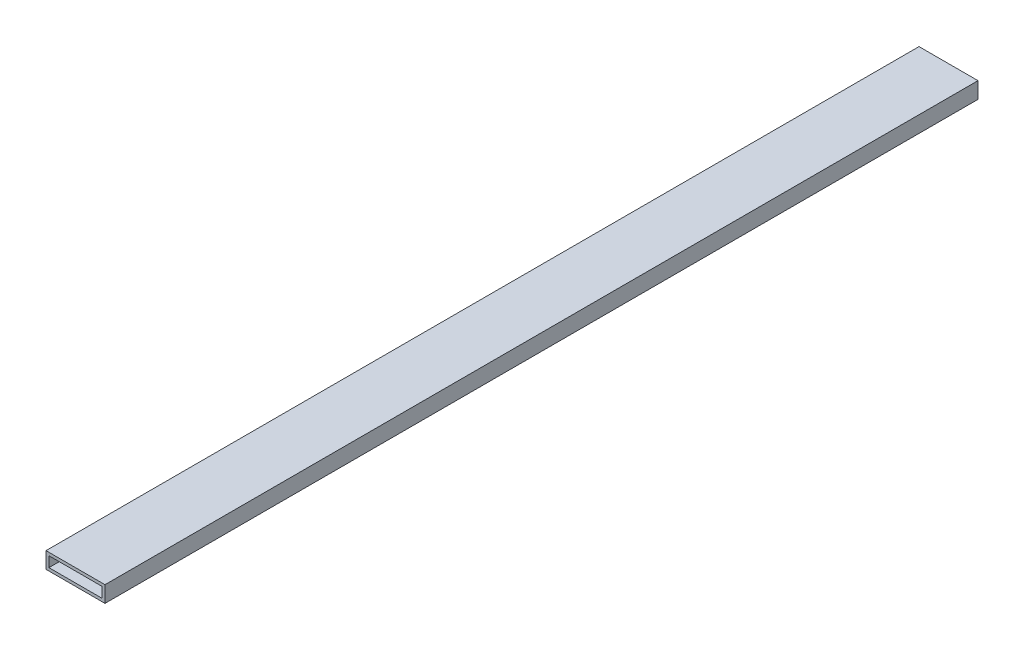
ISO-10303-21;
HEADER;
FILE_DESCRIPTION(('STEP AP214'),'2;1');
FILE_NAME('part.step','',(''),(''),'','','');
FILE_SCHEMA(('AUTOMOTIVE_DESIGN { 1 0 10303 214 1 1 1 1 }'));
ENDSEC;
DATA;
#1=APPLICATION_CONTEXT('core data for automotive mechanical design processes');
#2=APPLICATION_PROTOCOL_DEFINITION('international standard','automotive_design',2000,#1);
#3=PRODUCT_CONTEXT('',#1,'mechanical');
#4=PRODUCT('Part','Part','',(#3));
#5=PRODUCT_RELATED_PRODUCT_CATEGORY('part','',(#4));
#6=PRODUCT_DEFINITION_FORMATION('','',#4);
#7=PRODUCT_DEFINITION_CONTEXT('part definition',#1,'design');
#8=PRODUCT_DEFINITION('design','',#6,#7);
#9=PRODUCT_DEFINITION_SHAPE('','',#8);
#10=(LENGTH_UNIT() NAMED_UNIT(*) SI_UNIT(.MILLI.,.METRE.));
#11=(NAMED_UNIT(*) PLANE_ANGLE_UNIT() SI_UNIT($,.RADIAN.));
#12=(NAMED_UNIT(*) SI_UNIT($,.STERADIAN.) SOLID_ANGLE_UNIT());
#13=UNCERTAINTY_MEASURE_WITH_UNIT(LENGTH_MEASURE(1.E-05),#10,'distance_accuracy_value','');
#14=(GEOMETRIC_REPRESENTATION_CONTEXT(3) GLOBAL_UNCERTAINTY_ASSIGNED_CONTEXT((#13)) GLOBAL_UNIT_ASSIGNED_CONTEXT((#10,
#11,#12)) REPRESENTATION_CONTEXT('',''));
#15=CARTESIAN_POINT('',(0.,0.,0.));
#16=DIRECTION('',(0.,0.,1.));
#17=DIRECTION('',(1.,0.,0.));
#18=AXIS2_PLACEMENT_3D('',#15,#16,#17);
#19=CARTESIAN_POINT('',(0.,0.,592.));
#20=DIRECTION('',(0.,0.,-1.));
#21=DIRECTION('',(-1.,0.,0.));
#22=AXIS2_PLACEMENT_3D('',#19,#20,#21);
#23=PLANE('',#22);
#24=DIRECTION('',(0.,1.,0.));
#25=VECTOR('',#24,1.);
#26=CARTESIAN_POINT('',(20.,-5.5,592.));
#27=LINE('',#26,#25);
#28=CARTESIAN_POINT('',(20.,-5.5,592.));
#29=VERTEX_POINT('',#28);
#30=CARTESIAN_POINT('',(20.,5.5,592.));
#31=VERTEX_POINT('',#30);
#32=EDGE_CURVE('E153',#29,#31,#27,.T.);
#33=ORIENTED_EDGE('',*,*,#32,.T.);
#34=DIRECTION('',(-1.,0.,0.));
#35=VECTOR('',#34,1.);
#36=CARTESIAN_POINT('',(-20.,5.5,592.));
#37=LINE('',#36,#35);
#38=CARTESIAN_POINT('',(-20.,5.5,592.));
#39=VERTEX_POINT('',#38);
#40=EDGE_CURVE('E157',#31,#39,#37,.T.);
#41=ORIENTED_EDGE('',*,*,#40,.T.);
#42=DIRECTION('',(0.,-1.,0.));
#43=VECTOR('',#42,1.);
#44=CARTESIAN_POINT('',(-20.,-5.5,592.));
#45=LINE('',#44,#43);
#46=CARTESIAN_POINT('',(-20.,-5.5,592.));
#47=VERTEX_POINT('',#46);
#48=EDGE_CURVE('E161',#39,#47,#45,.T.);
#49=ORIENTED_EDGE('',*,*,#48,.T.);
#50=DIRECTION('',(1.,0.,0.));
#51=VECTOR('',#50,1.);
#52=CARTESIAN_POINT('',(-20.,-5.5,592.));
#53=LINE('',#52,#51);
#54=EDGE_CURVE('E164',#47,#29,#53,.T.);
#55=ORIENTED_EDGE('',*,*,#54,.T.);
#56=EDGE_LOOP('',(#33,#41,#49,#55));
#57=FACE_BOUND('',#56,.T.);
#58=DIRECTION('',(0.,-1.,0.));
#59=VECTOR('',#58,1.);
#60=CARTESIAN_POINT('',(-18.,-3.5,592.));
#61=LINE('',#60,#59);
#62=CARTESIAN_POINT('',(-18.,3.5,592.));
#63=VERTEX_POINT('',#62);
#64=CARTESIAN_POINT('',(-18.,-3.5,592.));
#65=VERTEX_POINT('',#64);
#66=EDGE_CURVE('E105',#63,#65,#61,.T.);
#67=ORIENTED_EDGE('',*,*,#66,.F.);
#68=DIRECTION('',(-1.,0.,0.));
#69=VECTOR('',#68,1.);
#70=CARTESIAN_POINT('',(-18.,3.5,592.));
#71=LINE('',#70,#69);
#72=CARTESIAN_POINT('',(18.,3.5,592.));
#73=VERTEX_POINT('',#72);
#74=EDGE_CURVE('E131',#73,#63,#71,.T.);
#75=ORIENTED_EDGE('',*,*,#74,.F.);
#76=DIRECTION('',(0.,1.,0.));
#77=VECTOR('',#76,1.);
#78=CARTESIAN_POINT('',(18.,-3.5,592.));
#79=LINE('',#78,#77);
#80=CARTESIAN_POINT('',(18.,-3.5,592.));
#81=VERTEX_POINT('',#80);
#82=EDGE_CURVE('E127',#81,#73,#79,.T.);
#83=ORIENTED_EDGE('',*,*,#82,.F.);
#84=DIRECTION('',(1.,0.,0.));
#85=VECTOR('',#84,1.);
#86=CARTESIAN_POINT('',(-18.,-3.5,592.));
#87=LINE('',#86,#85);
#88=EDGE_CURVE('E114',#65,#81,#87,.T.);
#89=ORIENTED_EDGE('',*,*,#88,.F.);
#90=EDGE_LOOP('',(#67,#75,#83,#89));
#91=FACE_BOUND('',#90,.T.);
#92=ADVANCED_FACE('F39',(#57,#91),#23,.F.);
#93=CARTESIAN_POINT('',(0.,0.,0.));
#94=DIRECTION('',(0.,0.,-1.));
#95=DIRECTION('',(-1.,0.,0.));
#96=AXIS2_PLACEMENT_3D('',#93,#94,#95);
#97=PLANE('',#96);
#98=DIRECTION('',(0.,1.,0.));
#99=VECTOR('',#98,1.);
#100=CARTESIAN_POINT('',(20.,-5.5,0.));
#101=LINE('',#100,#99);
#102=CARTESIAN_POINT('',(20.,-5.5,0.));
#103=VERTEX_POINT('',#102);
#104=CARTESIAN_POINT('',(20.,5.5,0.));
#105=VERTEX_POINT('',#104);
#106=EDGE_CURVE('E123',#103,#105,#101,.T.);
#107=ORIENTED_EDGE('',*,*,#106,.F.);
#108=DIRECTION('',(1.,0.,0.));
#109=VECTOR('',#108,1.);
#110=CARTESIAN_POINT('',(-20.,-5.5,0.));
#111=LINE('',#110,#109);
#112=CARTESIAN_POINT('',(-20.,-5.5,0.));
#113=VERTEX_POINT('',#112);
#114=EDGE_CURVE('E158',#113,#103,#111,.T.);
#115=ORIENTED_EDGE('',*,*,#114,.F.);
#116=DIRECTION('',(0.,-1.,0.));
#117=VECTOR('',#116,1.);
#118=CARTESIAN_POINT('',(-20.,-5.5,0.));
#119=LINE('',#118,#117);
#120=CARTESIAN_POINT('',(-20.,5.5,0.));
#121=VERTEX_POINT('',#120);
#122=EDGE_CURVE('E174',#121,#113,#119,.T.);
#123=ORIENTED_EDGE('',*,*,#122,.F.);
#124=DIRECTION('',(-1.,0.,0.));
#125=VECTOR('',#124,1.);
#126=CARTESIAN_POINT('',(-20.,5.5,0.));
#127=LINE('',#126,#125);
#128=EDGE_CURVE('E171',#105,#121,#127,.T.);
#129=ORIENTED_EDGE('',*,*,#128,.F.);
#130=EDGE_LOOP('',(#107,#115,#123,#129));
#131=FACE_BOUND('',#130,.T.);
#132=DIRECTION('',(-1.,0.,0.));
#133=VECTOR('',#132,1.);
#134=CARTESIAN_POINT('',(-18.,3.5,0.));
#135=LINE('',#134,#133);
#136=CARTESIAN_POINT('',(18.,3.5,0.));
#137=VERTEX_POINT('',#136);
#138=CARTESIAN_POINT('',(-18.,3.5,0.));
#139=VERTEX_POINT('',#138);
#140=EDGE_CURVE('E115',#137,#139,#135,.T.);
#141=ORIENTED_EDGE('',*,*,#140,.T.);
#142=DIRECTION('',(0.,-1.,0.));
#143=VECTOR('',#142,1.);
#144=CARTESIAN_POINT('',(-18.,-3.5,0.));
#145=LINE('',#144,#143);
#146=CARTESIAN_POINT('',(-18.,-3.5,0.));
#147=VERTEX_POINT('',#146);
#148=EDGE_CURVE('E63',#139,#147,#145,.T.);
#149=ORIENTED_EDGE('',*,*,#148,.T.);
#150=DIRECTION('',(1.,0.,0.));
#151=VECTOR('',#150,1.);
#152=CARTESIAN_POINT('',(-18.,-3.5,0.));
#153=LINE('',#152,#151);
#154=CARTESIAN_POINT('',(18.,-3.5,0.));
#155=VERTEX_POINT('',#154);
#156=EDGE_CURVE('E121',#147,#155,#153,.T.);
#157=ORIENTED_EDGE('',*,*,#156,.T.);
#158=DIRECTION('',(0.,1.,0.));
#159=VECTOR('',#158,1.);
#160=CARTESIAN_POINT('',(18.,-3.5,0.));
#161=LINE('',#160,#159);
#162=EDGE_CURVE('E140',#155,#137,#161,.T.);
#163=ORIENTED_EDGE('',*,*,#162,.T.);
#164=EDGE_LOOP('',(#141,#149,#157,#163));
#165=FACE_BOUND('',#164,.T.);
#166=ADVANCED_FACE('F197',(#131,#165),#97,.T.);
#167=CARTESIAN_POINT('',(20.,-5.5,592.));
#168=DIRECTION('',(-1.,0.,0.));
#169=DIRECTION('',(0.,0.,1.));
#170=AXIS2_PLACEMENT_3D('',#167,#168,#169);
#171=PLANE('',#170);
#172=ORIENTED_EDGE('',*,*,#106,.T.);
#173=DIRECTION('',(0.,0.,-1.));
#174=VECTOR('',#173,1.);
#175=CARTESIAN_POINT('',(20.,5.5,592.));
#176=LINE('',#175,#174);
#177=EDGE_CURVE('E11',#31,#105,#176,.T.);
#178=ORIENTED_EDGE('',*,*,#177,.F.);
#179=ORIENTED_EDGE('',*,*,#32,.F.);
#180=DIRECTION('',(0.,0.,-1.));
#181=VECTOR('',#180,1.);
#182=CARTESIAN_POINT('',(20.,-5.5,592.));
#183=LINE('',#182,#181);
#184=EDGE_CURVE('E167',#29,#103,#183,.T.);
#185=ORIENTED_EDGE('',*,*,#184,.T.);
#186=EDGE_LOOP('',(#172,#178,#179,#185));
#187=FACE_BOUND('',#186,.T.);
#188=ADVANCED_FACE('F41',(#187),#171,.F.);
#189=CARTESIAN_POINT('',(-20.,5.5,592.));
#190=DIRECTION('',(0.,-1.,0.));
#191=DIRECTION('',(0.,0.,-1.));
#192=AXIS2_PLACEMENT_3D('',#189,#190,#191);
#193=PLANE('',#192);
#194=ORIENTED_EDGE('',*,*,#128,.T.);
#195=DIRECTION('',(0.,0.,-1.));
#196=VECTOR('',#195,1.);
#197=CARTESIAN_POINT('',(-20.,5.5,592.));
#198=LINE('',#197,#196);
#199=EDGE_CURVE('E48',#39,#121,#198,.T.);
#200=ORIENTED_EDGE('',*,*,#199,.F.);
#201=ORIENTED_EDGE('',*,*,#40,.F.);
#202=ORIENTED_EDGE('',*,*,#177,.T.);
#203=EDGE_LOOP('',(#194,#200,#201,#202));
#204=FACE_BOUND('',#203,.T.);
#205=ADVANCED_FACE('F207',(#204),#193,.F.);
#206=CARTESIAN_POINT('',(-20.,-5.5,592.));
#207=DIRECTION('',(1.,0.,0.));
#208=DIRECTION('',(0.,0.,-1.));
#209=AXIS2_PLACEMENT_3D('',#206,#207,#208);
#210=PLANE('',#209);
#211=ORIENTED_EDGE('',*,*,#122,.T.);
#212=DIRECTION('',(0.,0.,-1.));
#213=VECTOR('',#212,1.);
#214=CARTESIAN_POINT('',(-20.,-5.5,592.));
#215=LINE('',#214,#213);
#216=EDGE_CURVE('E182',#47,#113,#215,.T.);
#217=ORIENTED_EDGE('',*,*,#216,.F.);
#218=ORIENTED_EDGE('',*,*,#48,.F.);
#219=ORIENTED_EDGE('',*,*,#199,.T.);
#220=EDGE_LOOP('',(#211,#217,#218,#219));
#221=FACE_BOUND('',#220,.T.);
#222=ADVANCED_FACE('F191',(#221),#210,.F.);
#223=CARTESIAN_POINT('',(-20.,-5.5,592.));
#224=DIRECTION('',(0.,1.,0.));
#225=DIRECTION('',(0.,0.,1.));
#226=AXIS2_PLACEMENT_3D('',#223,#224,#225);
#227=PLANE('',#226);
#228=ORIENTED_EDGE('',*,*,#114,.T.);
#229=ORIENTED_EDGE('',*,*,#184,.F.);
#230=ORIENTED_EDGE('',*,*,#54,.F.);
#231=ORIENTED_EDGE('',*,*,#216,.T.);
#232=EDGE_LOOP('',(#228,#229,#230,#231));
#233=FACE_BOUND('',#232,.T.);
#234=ADVANCED_FACE('F201',(#233),#227,.F.);
#235=CARTESIAN_POINT('',(-18.,-3.5,592.));
#236=DIRECTION('',(1.,0.,0.));
#237=DIRECTION('',(0.,0.,-1.));
#238=AXIS2_PLACEMENT_3D('',#235,#236,#237);
#239=PLANE('',#238);
#240=ORIENTED_EDGE('',*,*,#148,.F.);
#241=DIRECTION('',(0.,0.,-1.));
#242=VECTOR('',#241,1.);
#243=CARTESIAN_POINT('',(-18.,3.5,592.));
#244=LINE('',#243,#242);
#245=EDGE_CURVE('E109',#63,#139,#244,.T.);
#246=ORIENTED_EDGE('',*,*,#245,.F.);
#247=ORIENTED_EDGE('',*,*,#66,.T.);
#248=DIRECTION('',(0.,0.,-1.));
#249=VECTOR('',#248,1.);
#250=CARTESIAN_POINT('',(-18.,-3.5,592.));
#251=LINE('',#250,#249);
#252=EDGE_CURVE('E108',#65,#147,#251,.T.);
#253=ORIENTED_EDGE('',*,*,#252,.T.);
#254=EDGE_LOOP('',(#240,#246,#247,#253));
#255=FACE_BOUND('',#254,.T.);
#256=ADVANCED_FACE('F107',(#255),#239,.T.);
#257=CARTESIAN_POINT('',(-18.,-3.5,592.));
#258=DIRECTION('',(0.,1.,0.));
#259=DIRECTION('',(0.,0.,1.));
#260=AXIS2_PLACEMENT_3D('',#257,#258,#259);
#261=PLANE('',#260);
#262=ORIENTED_EDGE('',*,*,#156,.F.);
#263=ORIENTED_EDGE('',*,*,#252,.F.);
#264=ORIENTED_EDGE('',*,*,#88,.T.);
#265=DIRECTION('',(0.,0.,-1.));
#266=VECTOR('',#265,1.);
#267=CARTESIAN_POINT('',(18.,-3.5,592.));
#268=LINE('',#267,#266);
#269=EDGE_CURVE('E124',#81,#155,#268,.T.);
#270=ORIENTED_EDGE('',*,*,#269,.T.);
#271=EDGE_LOOP('',(#262,#263,#264,#270));
#272=FACE_BOUND('',#271,.T.);
#273=ADVANCED_FACE('F118',(#272),#261,.T.);
#274=CARTESIAN_POINT('',(18.,-3.5,592.));
#275=DIRECTION('',(-1.,0.,0.));
#276=DIRECTION('',(0.,-1.,0.));
#277=AXIS2_PLACEMENT_3D('',#274,#275,#276);
#278=PLANE('',#277);
#279=ORIENTED_EDGE('',*,*,#162,.F.);
#280=ORIENTED_EDGE('',*,*,#269,.F.);
#281=ORIENTED_EDGE('',*,*,#82,.T.);
#282=DIRECTION('',(0.,0.,-1.));
#283=VECTOR('',#282,1.);
#284=CARTESIAN_POINT('',(18.,3.5,592.));
#285=LINE('',#284,#283);
#286=EDGE_CURVE('E55',#73,#137,#285,.T.);
#287=ORIENTED_EDGE('',*,*,#286,.T.);
#288=EDGE_LOOP('',(#279,#280,#281,#287));
#289=FACE_BOUND('',#288,.T.);
#290=ADVANCED_FACE('F230',(#289),#278,.T.);
#291=CARTESIAN_POINT('',(-18.,3.5,592.));
#292=DIRECTION('',(0.,-1.,0.));
#293=DIRECTION('',(0.,0.,-1.));
#294=AXIS2_PLACEMENT_3D('',#291,#292,#293);
#295=PLANE('',#294);
#296=ORIENTED_EDGE('',*,*,#140,.F.);
#297=ORIENTED_EDGE('',*,*,#286,.F.);
#298=ORIENTED_EDGE('',*,*,#74,.T.);
#299=ORIENTED_EDGE('',*,*,#245,.T.);
#300=EDGE_LOOP('',(#296,#297,#298,#299));
#301=FACE_BOUND('',#300,.T.);
#302=ADVANCED_FACE('F234',(#301),#295,.T.);
#303=CLOSED_SHELL('',(#92,#166,#188,#205,#222,#234,#256,#273,#290,#302));
#304=MANIFOLD_SOLID_BREP('B2',#303);
#305=ADVANCED_BREP_SHAPE_REPRESENTATION('',(#18,#304),#14);
#306=SHAPE_DEFINITION_REPRESENTATION(#9,#305);
ENDSEC;
END-ISO-10303-21;
